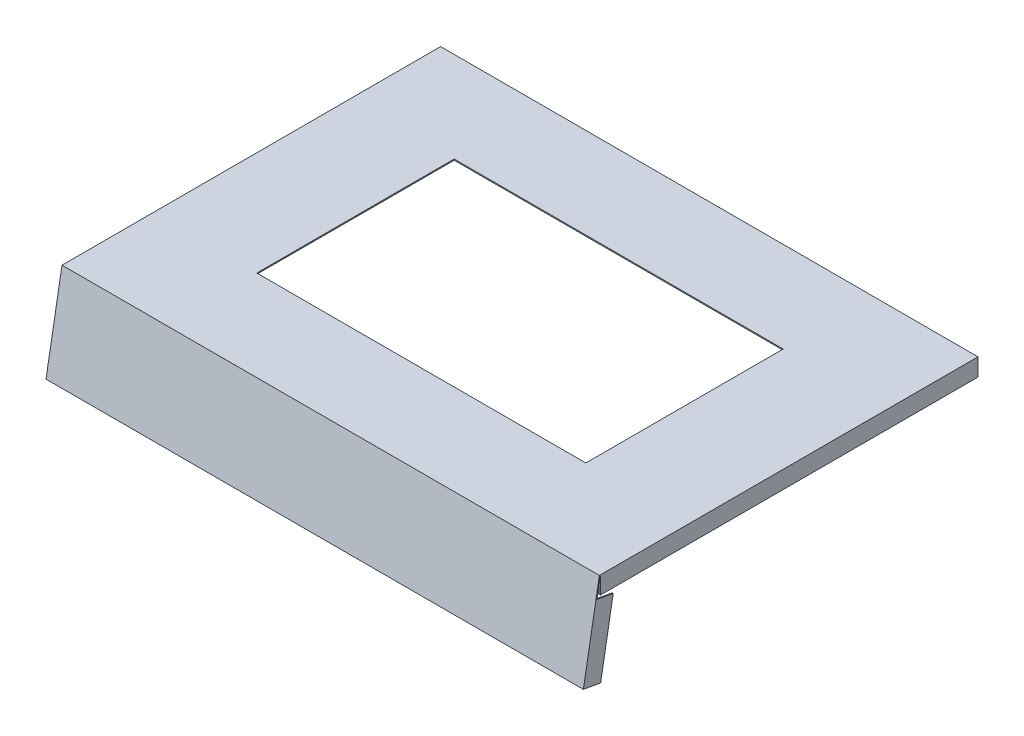
ISO-10303-21;
HEADER;
FILE_DESCRIPTION(('STEP AP214'),'2;1');
FILE_NAME('part.step','',(''),(''),'','','');
FILE_SCHEMA(('AUTOMOTIVE_DESIGN { 1 0 10303 214 1 1 1 1 }'));
ENDSEC;
DATA;
#1=APPLICATION_CONTEXT('core data for automotive mechanical design processes');
#2=APPLICATION_PROTOCOL_DEFINITION('international standard','automotive_design',2000,#1);
#3=PRODUCT_CONTEXT('',#1,'mechanical');
#4=PRODUCT('Part','Part','',(#3));
#5=PRODUCT_RELATED_PRODUCT_CATEGORY('part','',(#4));
#6=PRODUCT_DEFINITION_FORMATION('','',#4);
#7=PRODUCT_DEFINITION_CONTEXT('part definition',#1,'design');
#8=PRODUCT_DEFINITION('design','',#6,#7);
#9=PRODUCT_DEFINITION_SHAPE('','',#8);
#10=(LENGTH_UNIT() NAMED_UNIT(*) SI_UNIT(.MILLI.,.METRE.));
#11=(NAMED_UNIT(*) PLANE_ANGLE_UNIT() SI_UNIT($,.RADIAN.));
#12=(NAMED_UNIT(*) SI_UNIT($,.STERADIAN.) SOLID_ANGLE_UNIT());
#13=UNCERTAINTY_MEASURE_WITH_UNIT(LENGTH_MEASURE(1.E-05),#10,'distance_accuracy_value','');
#14=(GEOMETRIC_REPRESENTATION_CONTEXT(3) GLOBAL_UNCERTAINTY_ASSIGNED_CONTEXT((#13)) GLOBAL_UNIT_ASSIGNED_CONTEXT((#10,
#11,#12)) REPRESENTATION_CONTEXT('',''));
#15=CARTESIAN_POINT('',(0.,0.,0.));
#16=DIRECTION('',(0.,0.,1.));
#17=DIRECTION('',(1.,0.,0.));
#18=AXIS2_PLACEMENT_3D('',#15,#16,#17);
#19=CARTESIAN_POINT('',(-245.,-81.8974994306925,186.22663917101));
#20=DIRECTION('',(0.,-0.173648177666928,-0.984807753012209));
#21=DIRECTION('',(0.,0.984807753012209,-0.173648177666928));
#22=AXIS2_PLACEMENT_3D('',#19,#20,#21);
#23=PLANE('',#22);
#24=DIRECTION('',(0.,0.984807753012209,-0.173648177666928));
#25=VECTOR('',#24,1.);
#26=CARTESIAN_POINT('',(245.,-81.8974994306925,186.22663917101));
#27=LINE('',#26,#25);
#28=CARTESIAN_POINT('',(245.,-16.9001877318867,174.765859444992));
#29=VERTEX_POINT('',#28);
#30=CARTESIAN_POINT('',(245.,0.,171.785900368823));
#31=VERTEX_POINT('',#30);
#32=EDGE_CURVE('E258',#29,#31,#27,.T.);
#33=ORIENTED_EDGE('',*,*,#32,.F.);
#34=DIRECTION('',(1.,0.,0.));
#35=VECTOR('',#34,1.);
#36=CARTESIAN_POINT('',(244.,-16.9001877318867,174.765859444992));
#37=LINE('',#36,#35);
#38=CARTESIAN_POINT('',(244.,-16.9001877318867,174.765859444992));
#39=VERTEX_POINT('',#38);
#40=EDGE_CURVE('E203',#39,#29,#37,.T.);
#41=ORIENTED_EDGE('',*,*,#40,.F.);
#42=DIRECTION('',(0.,0.984807753012208,-0.173648177666927));
#43=VECTOR('',#42,1.);
#44=CARTESIAN_POINT('',(244.,-80.9126916776803,186.052990993343));
#45=LINE('',#44,#43);
#46=CARTESIAN_POINT('',(244.,-80.9126916776803,186.052990993343));
#47=VERTEX_POINT('',#46);
#48=EDGE_CURVE('E199',#47,#39,#45,.T.);
#49=ORIENTED_EDGE('',*,*,#48,.F.);
#50=DIRECTION('',(1.,0.,0.));
#51=VECTOR('',#50,1.);
#52=CARTESIAN_POINT('',(244.,-80.9126916776803,186.052990993343));
#53=LINE('',#52,#51);
#54=CARTESIAN_POINT('',(-244.,-80.9126916776803,186.052990993343));
#55=VERTEX_POINT('',#54);
#56=EDGE_CURVE('E350',#55,#47,#53,.T.);
#57=ORIENTED_EDGE('',*,*,#56,.F.);
#58=DIRECTION('',(0.,-0.984807753012209,0.173648177666927));
#59=VECTOR('',#58,1.);
#60=CARTESIAN_POINT('',(-244.,-80.9126916776803,186.052990993343));
#61=LINE('',#60,#59);
#62=CARTESIAN_POINT('',(-244.,-16.9001877318867,174.765859444992));
#63=VERTEX_POINT('',#62);
#64=EDGE_CURVE('E342',#63,#55,#61,.T.);
#65=ORIENTED_EDGE('',*,*,#64,.F.);
#66=DIRECTION('',(1.,0.,0.));
#67=VECTOR('',#66,1.);
#68=CARTESIAN_POINT('',(-244.,-16.9001877318867,174.765859444992));
#69=LINE('',#68,#67);
#70=CARTESIAN_POINT('',(-245.,-16.9001877318867,174.765859444992));
#71=VERTEX_POINT('',#70);
#72=EDGE_CURVE('E339',#71,#63,#69,.T.);
#73=ORIENTED_EDGE('',*,*,#72,.F.);
#74=DIRECTION('',(0.,0.984807753012209,-0.173648177666928));
#75=VECTOR('',#74,1.);
#76=CARTESIAN_POINT('',(-245.,-81.8974994306925,186.22663917101));
#77=LINE('',#76,#75);
#78=CARTESIAN_POINT('',(-245.,0.,171.785900368823));
#79=VERTEX_POINT('',#78);
#80=EDGE_CURVE('E260',#71,#79,#77,.T.);
#81=ORIENTED_EDGE('',*,*,#80,.T.);
#82=DIRECTION('',(1.,0.,0.));
#83=VECTOR('',#82,1.);
#84=CARTESIAN_POINT('',(0.,0.,171.785900368823));
#85=LINE('',#84,#83);
#86=CARTESIAN_POINT('',(-244.,0.,171.785900368823));
#87=VERTEX_POINT('',#86);
#88=EDGE_CURVE('E41',#79,#87,#85,.T.);
#89=ORIENTED_EDGE('',*,*,#88,.T.);
#90=CARTESIAN_POINT('',(244.,0.,171.785900368823));
#91=VERTEX_POINT('',#90);
#92=EDGE_CURVE('E309',#87,#91,#85,.T.);
#93=ORIENTED_EDGE('',*,*,#92,.T.);
#94=DIRECTION('',(-1.,0.,0.));
#95=VECTOR('',#94,1.);
#96=CARTESIAN_POINT('',(245.,0.,171.785900368823));
#97=LINE('',#96,#95);
#98=EDGE_CURVE('E205',#31,#91,#97,.T.);
#99=ORIENTED_EDGE('',*,*,#98,.F.);
#100=EDGE_LOOP('',(#33,#41,#49,#57,#65,#73,#81,#89,#93,#99));
#101=FACE_BOUND('',#100,.T.);
#102=ADVANCED_FACE('F33',(#101),#23,.T.);
#103=CARTESIAN_POINT('',(0.,0.,0.));
#104=DIRECTION('',(0.,-1.,0.));
#105=DIRECTION('',(0.,0.,-1.));
#106=AXIS2_PLACEMENT_3D('',#103,#104,#105);
#107=PLANE('',#106);
#108=DIRECTION('',(0.,0.,-1.));
#109=VECTOR('',#108,1.);
#110=CARTESIAN_POINT('',(150.,0.,90.));
#111=LINE('',#110,#109);
#112=CARTESIAN_POINT('',(150.,0.,90.));
#113=VERTEX_POINT('',#112);
#114=CARTESIAN_POINT('',(150.,0.,-90.));
#115=VERTEX_POINT('',#114);
#116=EDGE_CURVE('E267',#113,#115,#111,.T.);
#117=ORIENTED_EDGE('',*,*,#116,.T.);
#118=DIRECTION('',(-1.,0.,0.));
#119=VECTOR('',#118,1.);
#120=CARTESIAN_POINT('',(-150.,0.,-90.));
#121=LINE('',#120,#119);
#122=CARTESIAN_POINT('',(-150.,0.,-90.));
#123=VERTEX_POINT('',#122);
#124=EDGE_CURVE('E270',#115,#123,#121,.T.);
#125=ORIENTED_EDGE('',*,*,#124,.T.);
#126=DIRECTION('',(0.,0.,1.));
#127=VECTOR('',#126,1.);
#128=CARTESIAN_POINT('',(-150.,0.,90.));
#129=LINE('',#128,#127);
#130=CARTESIAN_POINT('',(-150.,0.,90.));
#131=VERTEX_POINT('',#130);
#132=EDGE_CURVE('E274',#123,#131,#129,.T.);
#133=ORIENTED_EDGE('',*,*,#132,.T.);
#134=DIRECTION('',(1.,0.,0.));
#135=VECTOR('',#134,1.);
#136=CARTESIAN_POINT('',(-150.,0.,90.));
#137=LINE('',#136,#135);
#138=EDGE_CURVE('E277',#131,#113,#137,.T.);
#139=ORIENTED_EDGE('',*,*,#138,.T.);
#140=EDGE_LOOP('',(#117,#125,#133,#139));
#141=FACE_BOUND('',#140,.T.);
#142=DIRECTION('',(-1.,0.,0.));
#143=VECTOR('',#142,1.);
#144=CARTESIAN_POINT('',(-244.,0.,-171.625));
#145=LINE('',#144,#143);
#146=CARTESIAN_POINT('',(244.,0.,-171.625));
#147=VERTEX_POINT('',#146);
#148=CARTESIAN_POINT('',(-244.,0.,-171.625));
#149=VERTEX_POINT('',#148);
#150=EDGE_CURVE('E235',#147,#149,#145,.T.);
#151=ORIENTED_EDGE('',*,*,#150,.F.);
#152=DIRECTION('',(0.,0.,-1.));
#153=VECTOR('',#152,1.);
#154=CARTESIAN_POINT('',(244.,0.,-171.625));
#155=LINE('',#154,#153);
#156=EDGE_CURVE('E208',#91,#147,#155,.T.);
#157=ORIENTED_EDGE('',*,*,#156,.F.);
#158=ORIENTED_EDGE('',*,*,#92,.F.);
#159=DIRECTION('',(0.,0.,1.));
#160=VECTOR('',#159,1.);
#161=CARTESIAN_POINT('',(-244.,0.,-171.625));
#162=LINE('',#161,#160);
#163=EDGE_CURVE('E218',#149,#87,#162,.T.);
#164=ORIENTED_EDGE('',*,*,#163,.F.);
#165=EDGE_LOOP('',(#151,#157,#158,#164));
#166=FACE_BOUND('',#165,.T.);
#167=ADVANCED_FACE('F319',(#141,#166),#107,.T.);
#168=CARTESIAN_POINT('',(245.,1.,172.625));
#169=DIRECTION('',(-1.,0.,0.));
#170=DIRECTION('',(0.,0.,1.));
#171=AXIS2_PLACEMENT_3D('',#168,#169,#170);
#172=PLANE('',#171);
#173=DIRECTION('',(0.,-1.,0.));
#174=VECTOR('',#173,1.);
#175=CARTESIAN_POINT('',(245.,1.,-172.625));
#176=LINE('',#175,#174);
#177=CARTESIAN_POINT('',(245.,1.,-172.625));
#178=VERTEX_POINT('',#177);
#179=CARTESIAN_POINT('',(245.,-15.,-172.625));
#180=VERTEX_POINT('',#179);
#181=EDGE_CURVE('E308',#178,#180,#176,.T.);
#182=ORIENTED_EDGE('',*,*,#181,.F.);
#183=DIRECTION('',(0.,0.,-1.));
#184=VECTOR('',#183,1.);
#185=CARTESIAN_POINT('',(245.,1.,172.625));
#186=LINE('',#185,#184);
#187=CARTESIAN_POINT('',(245.,1.,172.625));
#188=VERTEX_POINT('',#187);
#189=EDGE_CURVE('E292',#188,#178,#186,.T.);
#190=ORIENTED_EDGE('',*,*,#189,.F.);
#191=DIRECTION('',(0.,-0.984807753012209,0.173648177666927));
#192=VECTOR('',#191,1.);
#193=CARTESIAN_POINT('',(245.,1.,172.625));
#194=LINE('',#193,#192);
#195=CARTESIAN_POINT('',(245.,-81.7238512530255,187.211446924022));
#196=VERTEX_POINT('',#195);
#197=EDGE_CURVE('E253',#188,#196,#194,.T.);
#198=ORIENTED_EDGE('',*,*,#197,.T.);
#199=DIRECTION('',(0.,-0.173648177666948,-0.984807753012205));
#200=VECTOR('',#199,1.);
#201=CARTESIAN_POINT('',(245.,-81.7238512530255,187.211446924022));
#202=LINE('',#201,#200);
#203=CARTESIAN_POINT('',(245.,-84.5022220956964,171.454522875826));
#204=VERTEX_POINT('',#203);
#205=EDGE_CURVE('E185',#196,#204,#202,.T.);
#206=ORIENTED_EDGE('',*,*,#205,.T.);
#207=DIRECTION('',(0.,-0.984807753012208,0.173648177666927));
#208=VECTOR('',#207,1.);
#209=CARTESIAN_POINT('',(245.,-19.5049103968907,159.993743149809));
#210=LINE('',#209,#208);
#211=CARTESIAN_POINT('',(245.,-19.5049103968907,159.993743149809));
#212=VERTEX_POINT('',#211);
#213=EDGE_CURVE('E177',#212,#204,#210,.T.);
#214=ORIENTED_EDGE('',*,*,#213,.F.);
#215=DIRECTION('',(0.,0.173648177666927,0.984807753012209));
#216=VECTOR('',#215,1.);
#217=CARTESIAN_POINT('',(245.,-19.5049103968907,159.993743149809));
#218=LINE('',#217,#216);
#219=EDGE_CURVE('E181',#212,#29,#218,.T.);
#220=ORIENTED_EDGE('',*,*,#219,.T.);
#221=ORIENTED_EDGE('',*,*,#32,.T.);
#222=DIRECTION('',(0.,1.,0.));
#223=VECTOR('',#222,1.);
#224=CARTESIAN_POINT('',(245.,-15.,171.785900368823));
#225=LINE('',#224,#223);
#226=CARTESIAN_POINT('',(245.,-15.,171.785900368823));
#227=VERTEX_POINT('',#226);
#228=EDGE_CURVE('E250',#227,#31,#225,.T.);
#229=ORIENTED_EDGE('',*,*,#228,.F.);
#230=DIRECTION('',(0.,0.,1.));
#231=VECTOR('',#230,1.);
#232=CARTESIAN_POINT('',(245.,-15.,-172.625));
#233=LINE('',#232,#231);
#234=EDGE_CURVE('E217',#180,#227,#233,.T.);
#235=ORIENTED_EDGE('',*,*,#234,.F.);
#236=EDGE_LOOP('',(#182,#190,#198,#206,#214,#220,#221,#229,#235));
#237=FACE_BOUND('',#236,.T.);
#238=ADVANCED_FACE('F35',(#237),#172,.F.);
#239=CARTESIAN_POINT('',(-245.,1.,-172.625));
#240=DIRECTION('',(0.,0.,1.));
#241=DIRECTION('',(1.,0.,0.));
#242=AXIS2_PLACEMENT_3D('',#239,#240,#241);
#243=PLANE('',#242);
#244=ORIENTED_EDGE('',*,*,#181,.T.);
#245=DIRECTION('',(1.,0.,0.));
#246=VECTOR('',#245,1.);
#247=CARTESIAN_POINT('',(-245.,-15.,-172.625));
#248=LINE('',#247,#246);
#249=CARTESIAN_POINT('',(-245.,-15.,-172.625));
#250=VERTEX_POINT('',#249);
#251=EDGE_CURVE('E214',#250,#180,#248,.T.);
#252=ORIENTED_EDGE('',*,*,#251,.F.);
#253=DIRECTION('',(0.,-1.,0.));
#254=VECTOR('',#253,1.);
#255=CARTESIAN_POINT('',(-245.,1.,-172.625));
#256=LINE('',#255,#254);
#257=CARTESIAN_POINT('',(-245.,1.,-172.625));
#258=VERTEX_POINT('',#257);
#259=EDGE_CURVE('E306',#258,#250,#256,.T.);
#260=ORIENTED_EDGE('',*,*,#259,.F.);
#261=DIRECTION('',(-1.,0.,0.));
#262=VECTOR('',#261,1.);
#263=CARTESIAN_POINT('',(-245.,1.,-172.625));
#264=LINE('',#263,#262);
#265=EDGE_CURVE('E299',#178,#258,#264,.T.);
#266=ORIENTED_EDGE('',*,*,#265,.F.);
#267=EDGE_LOOP('',(#244,#252,#260,#266));
#268=FACE_BOUND('',#267,.T.);
#269=ADVANCED_FACE('F438',(#268),#243,.F.);
#270=CARTESIAN_POINT('',(-245.,1.,172.625));
#271=DIRECTION('',(1.,0.,0.));
#272=DIRECTION('',(0.,0.,-1.));
#273=AXIS2_PLACEMENT_3D('',#270,#271,#272);
#274=PLANE('',#273);
#275=CARTESIAN_POINT('',(-245.,-7.,-166.625));
#276=DIRECTION('',(1.,0.,0.));
#277=DIRECTION('',(0.,0.,-1.));
#278=AXIS2_PLACEMENT_3D('',#275,#276,#277);
#279=CIRCLE('',#278,1.5);
#280=CARTESIAN_POINT('',(-245.,-7.,-168.125));
#281=VERTEX_POINT('',#280);
#282=EDGE_CURVE('E11',#281,#281,#279,.F.);
#283=ORIENTED_EDGE('',*,*,#282,.F.);
#284=EDGE_LOOP('',(#283));
#285=FACE_BOUND('',#284,.T.);
#286=ORIENTED_EDGE('',*,*,#259,.T.);
#287=DIRECTION('',(0.,0.,-1.));
#288=VECTOR('',#287,1.);
#289=CARTESIAN_POINT('',(-245.,-15.,-172.625));
#290=LINE('',#289,#288);
#291=CARTESIAN_POINT('',(-245.,-15.,171.785900368823));
#292=VERTEX_POINT('',#291);
#293=EDGE_CURVE('E230',#292,#250,#290,.T.);
#294=ORIENTED_EDGE('',*,*,#293,.F.);
#295=DIRECTION('',(0.,1.,0.));
#296=VECTOR('',#295,1.);
#297=CARTESIAN_POINT('',(-245.,-15.,171.785900368823));
#298=LINE('',#297,#296);
#299=EDGE_CURVE('E232',#292,#79,#298,.T.);
#300=ORIENTED_EDGE('',*,*,#299,.T.);
#301=ORIENTED_EDGE('',*,*,#80,.F.);
#302=DIRECTION('',(0.,0.173648177666927,0.984807753012209));
#303=VECTOR('',#302,1.);
#304=CARTESIAN_POINT('',(-245.,-19.5049103968906,159.993743149809));
#305=LINE('',#304,#303);
#306=CARTESIAN_POINT('',(-245.,-19.5049103968906,159.993743149809));
#307=VERTEX_POINT('',#306);
#308=EDGE_CURVE('E206',#307,#71,#305,.T.);
#309=ORIENTED_EDGE('',*,*,#308,.F.);
#310=DIRECTION('',(0.,0.984807753012209,-0.173648177666927));
#311=VECTOR('',#310,1.);
#312=CARTESIAN_POINT('',(-245.,-19.5049103968906,159.993743149809));
#313=LINE('',#312,#311);
#314=CARTESIAN_POINT('',(-245.,-84.5022220956964,171.454522875826));
#315=VERTEX_POINT('',#314);
#316=EDGE_CURVE('E383',#315,#307,#313,.T.);
#317=ORIENTED_EDGE('',*,*,#316,.F.);
#318=DIRECTION('',(0.,-0.173648177666948,-0.984807753012205));
#319=VECTOR('',#318,1.);
#320=CARTESIAN_POINT('',(-245.,-81.7238512530255,187.211446924022));
#321=LINE('',#320,#319);
#322=CARTESIAN_POINT('',(-245.,-81.7238512530255,187.211446924022));
#323=VERTEX_POINT('',#322);
#324=EDGE_CURVE('E257',#323,#315,#321,.T.);
#325=ORIENTED_EDGE('',*,*,#324,.F.);
#326=DIRECTION('',(0.,-0.984807753012209,0.173648177666927));
#327=VECTOR('',#326,1.);
#328=CARTESIAN_POINT('',(-245.,1.,172.625));
#329=LINE('',#328,#327);
#330=CARTESIAN_POINT('',(-245.,1.,172.625));
#331=VERTEX_POINT('',#330);
#332=EDGE_CURVE('E254',#331,#323,#329,.T.);
#333=ORIENTED_EDGE('',*,*,#332,.F.);
#334=DIRECTION('',(0.,0.,1.));
#335=VECTOR('',#334,1.);
#336=CARTESIAN_POINT('',(-245.,1.,172.625));
#337=LINE('',#336,#335);
#338=EDGE_CURVE('E301',#258,#331,#337,.T.);
#339=ORIENTED_EDGE('',*,*,#338,.F.);
#340=EDGE_LOOP('',(#286,#294,#300,#301,#309,#317,#325,#333,#339));
#341=FACE_BOUND('',#340,.T.);
#342=ADVANCED_FACE('F390',(#285,#341),#274,.F.);
#343=CARTESIAN_POINT('',(0.,1.,0.));
#344=DIRECTION('',(0.,-1.,0.));
#345=DIRECTION('',(0.,0.,-1.));
#346=AXIS2_PLACEMENT_3D('',#343,#344,#345);
#347=PLANE('',#346);
#348=DIRECTION('',(-1.,0.,0.));
#349=VECTOR('',#348,1.);
#350=CARTESIAN_POINT('',(-150.,1.,-90.));
#351=LINE('',#350,#349);
#352=CARTESIAN_POINT('',(150.,1.,-90.));
#353=VERTEX_POINT('',#352);
#354=CARTESIAN_POINT('',(-150.,1.,-90.));
#355=VERTEX_POINT('',#354);
#356=EDGE_CURVE('E282',#353,#355,#351,.T.);
#357=ORIENTED_EDGE('',*,*,#356,.F.);
#358=DIRECTION('',(0.,0.,-1.));
#359=VECTOR('',#358,1.);
#360=CARTESIAN_POINT('',(150.,1.,90.));
#361=LINE('',#360,#359);
#362=CARTESIAN_POINT('',(150.,1.,90.));
#363=VERTEX_POINT('',#362);
#364=EDGE_CURVE('E56',#363,#353,#361,.T.);
#365=ORIENTED_EDGE('',*,*,#364,.F.);
#366=DIRECTION('',(1.,0.,0.));
#367=VECTOR('',#366,1.);
#368=CARTESIAN_POINT('',(-150.,1.,90.));
#369=LINE('',#368,#367);
#370=CARTESIAN_POINT('',(-150.,1.,90.));
#371=VERTEX_POINT('',#370);
#372=EDGE_CURVE('E271',#371,#363,#369,.T.);
#373=ORIENTED_EDGE('',*,*,#372,.F.);
#374=DIRECTION('',(0.,0.,1.));
#375=VECTOR('',#374,1.);
#376=CARTESIAN_POINT('',(-150.,1.,90.));
#377=LINE('',#376,#375);
#378=EDGE_CURVE('E285',#355,#371,#377,.T.);
#379=ORIENTED_EDGE('',*,*,#378,.F.);
#380=EDGE_LOOP('',(#357,#365,#373,#379));
#381=FACE_BOUND('',#380,.T.);
#382=ORIENTED_EDGE('',*,*,#338,.T.);
#383=DIRECTION('',(1.,0.,0.));
#384=VECTOR('',#383,1.);
#385=CARTESIAN_POINT('',(-245.,1.,172.625));
#386=LINE('',#385,#384);
#387=EDGE_CURVE('E303',#331,#188,#386,.T.);
#388=ORIENTED_EDGE('',*,*,#387,.T.);
#389=ORIENTED_EDGE('',*,*,#189,.T.);
#390=ORIENTED_EDGE('',*,*,#265,.T.);
#391=EDGE_LOOP('',(#382,#388,#389,#390));
#392=FACE_BOUND('',#391,.T.);
#393=ADVANCED_FACE('F433',(#381,#392),#347,.F.);
#394=CARTESIAN_POINT('',(150.,0.,90.));
#395=DIRECTION('',(1.,0.,0.));
#396=DIRECTION('',(0.,0.,-1.));
#397=AXIS2_PLACEMENT_3D('',#394,#395,#396);
#398=PLANE('',#397);
#399=ORIENTED_EDGE('',*,*,#364,.T.);
#400=DIRECTION('',(0.,1.,0.));
#401=VECTOR('',#400,1.);
#402=CARTESIAN_POINT('',(150.,0.,-90.));
#403=LINE('',#402,#401);
#404=EDGE_CURVE('E280',#115,#353,#403,.T.);
#405=ORIENTED_EDGE('',*,*,#404,.F.);
#406=ORIENTED_EDGE('',*,*,#116,.F.);
#407=DIRECTION('',(0.,1.,0.));
#408=VECTOR('',#407,1.);
#409=CARTESIAN_POINT('',(150.,0.,90.));
#410=LINE('',#409,#408);
#411=EDGE_CURVE('E290',#113,#363,#410,.T.);
#412=ORIENTED_EDGE('',*,*,#411,.T.);
#413=EDGE_LOOP('',(#399,#405,#406,#412));
#414=FACE_BOUND('',#413,.T.);
#415=ADVANCED_FACE('F423',(#414),#398,.F.);
#416=CARTESIAN_POINT('',(-150.,0.,90.));
#417=DIRECTION('',(0.,0.,1.));
#418=DIRECTION('',(1.,0.,0.));
#419=AXIS2_PLACEMENT_3D('',#416,#417,#418);
#420=PLANE('',#419);
#421=ORIENTED_EDGE('',*,*,#372,.T.);
#422=ORIENTED_EDGE('',*,*,#411,.F.);
#423=ORIENTED_EDGE('',*,*,#138,.F.);
#424=DIRECTION('',(0.,1.,0.));
#425=VECTOR('',#424,1.);
#426=CARTESIAN_POINT('',(-150.,0.,90.));
#427=LINE('',#426,#425);
#428=EDGE_CURVE('E293',#131,#371,#427,.T.);
#429=ORIENTED_EDGE('',*,*,#428,.T.);
#430=EDGE_LOOP('',(#421,#422,#423,#429));
#431=FACE_BOUND('',#430,.T.);
#432=ADVANCED_FACE('F419',(#431),#420,.F.);
#433=CARTESIAN_POINT('',(-150.,0.,90.));
#434=DIRECTION('',(-1.,0.,0.));
#435=DIRECTION('',(0.,0.,1.));
#436=AXIS2_PLACEMENT_3D('',#433,#434,#435);
#437=PLANE('',#436);
#438=ORIENTED_EDGE('',*,*,#378,.T.);
#439=ORIENTED_EDGE('',*,*,#428,.F.);
#440=ORIENTED_EDGE('',*,*,#132,.F.);
#441=DIRECTION('',(0.,1.,0.));
#442=VECTOR('',#441,1.);
#443=CARTESIAN_POINT('',(-150.,0.,-90.));
#444=LINE('',#443,#442);
#445=EDGE_CURVE('E295',#123,#355,#444,.T.);
#446=ORIENTED_EDGE('',*,*,#445,.T.);
#447=EDGE_LOOP('',(#438,#439,#440,#446));
#448=FACE_BOUND('',#447,.T.);
#449=ADVANCED_FACE('F422',(#448),#437,.F.);
#450=CARTESIAN_POINT('',(-150.,0.,-90.));
#451=DIRECTION('',(0.,0.,-1.));
#452=DIRECTION('',(-1.,0.,0.));
#453=AXIS2_PLACEMENT_3D('',#450,#451,#452);
#454=PLANE('',#453);
#455=ORIENTED_EDGE('',*,*,#356,.T.);
#456=ORIENTED_EDGE('',*,*,#445,.F.);
#457=ORIENTED_EDGE('',*,*,#124,.F.);
#458=ORIENTED_EDGE('',*,*,#404,.T.);
#459=EDGE_LOOP('',(#455,#456,#457,#458));
#460=FACE_BOUND('',#459,.T.);
#461=ADVANCED_FACE('F415',(#460),#454,.F.);
#462=CARTESIAN_POINT('',(-245.,-81.7238512530255,187.211446924022));
#463=DIRECTION('',(0.,-0.984807753012205,0.173648177666948));
#464=DIRECTION('',(0.,-0.173648177666948,-0.984807753012205));
#465=AXIS2_PLACEMENT_3D('',#462,#463,#464);
#466=PLANE('',#465);
#467=ORIENTED_EDGE('',*,*,#205,.F.);
#468=DIRECTION('',(1.,0.,0.));
#469=VECTOR('',#468,1.);
#470=CARTESIAN_POINT('',(-245.,-81.7238512530255,187.211446924022));
#471=LINE('',#470,#469);
#472=EDGE_CURVE('E262',#323,#196,#471,.T.);
#473=ORIENTED_EDGE('',*,*,#472,.F.);
#474=ORIENTED_EDGE('',*,*,#324,.T.);
#475=DIRECTION('',(-1.,0.,0.));
#476=VECTOR('',#475,1.);
#477=CARTESIAN_POINT('',(245.,-84.5022220956964,171.454522875826));
#478=LINE('',#477,#476);
#479=EDGE_CURVE('E189',#204,#315,#478,.T.);
#480=ORIENTED_EDGE('',*,*,#479,.F.);
#481=EDGE_LOOP('',(#467,#473,#474,#480));
#482=FACE_BOUND('',#481,.T.);
#483=ADVANCED_FACE('F411',(#482),#466,.T.);
#484=CARTESIAN_POINT('',(-245.,1.,172.625));
#485=DIRECTION('',(0.,0.173648177666927,0.984807753012209));
#486=DIRECTION('',(0.,-0.984807753012209,0.173648177666927));
#487=AXIS2_PLACEMENT_3D('',#484,#485,#486);
#488=PLANE('',#487);
#489=ORIENTED_EDGE('',*,*,#197,.F.);
#490=ORIENTED_EDGE('',*,*,#387,.F.);
#491=ORIENTED_EDGE('',*,*,#332,.T.);
#492=ORIENTED_EDGE('',*,*,#472,.T.);
#493=EDGE_LOOP('',(#489,#490,#491,#492));
#494=FACE_BOUND('',#493,.T.);
#495=ADVANCED_FACE('F414',(#494),#488,.T.);
#496=CARTESIAN_POINT('',(245.,-15.,171.785900368823));
#497=DIRECTION('',(0.,0.,-1.));
#498=DIRECTION('',(-1.,0.,0.));
#499=AXIS2_PLACEMENT_3D('',#496,#497,#498);
#500=PLANE('',#499);
#501=ORIENTED_EDGE('',*,*,#98,.T.);
#502=DIRECTION('',(0.,1.,0.));
#503=VECTOR('',#502,1.);
#504=CARTESIAN_POINT('',(244.,-15.,171.785900368823));
#505=LINE('',#504,#503);
#506=CARTESIAN_POINT('',(244.,-15.,171.785900368823));
#507=VERTEX_POINT('',#506);
#508=EDGE_CURVE('E247',#507,#91,#505,.T.);
#509=ORIENTED_EDGE('',*,*,#508,.F.);
#510=DIRECTION('',(-1.,0.,0.));
#511=VECTOR('',#510,1.);
#512=CARTESIAN_POINT('',(245.,-15.,171.785900368823));
#513=LINE('',#512,#511);
#514=EDGE_CURVE('E220',#227,#507,#513,.T.);
#515=ORIENTED_EDGE('',*,*,#514,.F.);
#516=ORIENTED_EDGE('',*,*,#228,.T.);
#517=EDGE_LOOP('',(#501,#509,#515,#516));
#518=FACE_BOUND('',#517,.T.);
#519=ADVANCED_FACE('F336',(#518),#500,.F.);
#520=CARTESIAN_POINT('',(244.,-15.,-171.625));
#521=DIRECTION('',(1.,0.,0.));
#522=DIRECTION('',(0.,0.,-1.));
#523=AXIS2_PLACEMENT_3D('',#520,#521,#522);
#524=PLANE('',#523);
#525=ORIENTED_EDGE('',*,*,#156,.T.);
#526=DIRECTION('',(0.,1.,0.));
#527=VECTOR('',#526,1.);
#528=CARTESIAN_POINT('',(244.,-15.,-171.625));
#529=LINE('',#528,#527);
#530=CARTESIAN_POINT('',(244.,-15.,-171.625));
#531=VERTEX_POINT('',#530);
#532=EDGE_CURVE('E244',#531,#147,#529,.T.);
#533=ORIENTED_EDGE('',*,*,#532,.F.);
#534=DIRECTION('',(0.,0.,-1.));
#535=VECTOR('',#534,1.);
#536=CARTESIAN_POINT('',(244.,-15.,-171.625));
#537=LINE('',#536,#535);
#538=EDGE_CURVE('E222',#507,#531,#537,.T.);
#539=ORIENTED_EDGE('',*,*,#538,.F.);
#540=ORIENTED_EDGE('',*,*,#508,.T.);
#541=EDGE_LOOP('',(#525,#533,#539,#540));
#542=FACE_BOUND('',#541,.T.);
#543=ADVANCED_FACE('F322',(#542),#524,.F.);
#544=CARTESIAN_POINT('',(-244.,-15.,-171.625));
#545=DIRECTION('',(0.,0.,-1.));
#546=DIRECTION('',(-1.,0.,0.));
#547=AXIS2_PLACEMENT_3D('',#544,#545,#546);
#548=PLANE('',#547);
#549=ORIENTED_EDGE('',*,*,#150,.T.);
#550=DIRECTION('',(0.,1.,0.));
#551=VECTOR('',#550,1.);
#552=CARTESIAN_POINT('',(-244.,-15.,-171.625));
#553=LINE('',#552,#551);
#554=CARTESIAN_POINT('',(-244.,-15.,-171.625));
#555=VERTEX_POINT('',#554);
#556=EDGE_CURVE('E241',#555,#149,#553,.T.);
#557=ORIENTED_EDGE('',*,*,#556,.F.);
#558=DIRECTION('',(-1.,0.,0.));
#559=VECTOR('',#558,1.);
#560=CARTESIAN_POINT('',(-244.,-15.,-171.625));
#561=LINE('',#560,#559);
#562=EDGE_CURVE('E224',#531,#555,#561,.T.);
#563=ORIENTED_EDGE('',*,*,#562,.F.);
#564=ORIENTED_EDGE('',*,*,#532,.T.);
#565=EDGE_LOOP('',(#549,#557,#563,#564));
#566=FACE_BOUND('',#565,.T.);
#567=ADVANCED_FACE('F327',(#566),#548,.F.);
#568=CARTESIAN_POINT('',(-244.,-15.,-171.625));
#569=DIRECTION('',(-1.,0.,0.));
#570=DIRECTION('',(0.,0.,1.));
#571=AXIS2_PLACEMENT_3D('',#568,#569,#570);
#572=PLANE('',#571);
#573=ORIENTED_EDGE('',*,*,#163,.T.);
#574=DIRECTION('',(0.,1.,0.));
#575=VECTOR('',#574,1.);
#576=CARTESIAN_POINT('',(-244.,-15.,171.785900368823));
#577=LINE('',#576,#575);
#578=CARTESIAN_POINT('',(-244.,-15.,171.785900368823));
#579=VERTEX_POINT('',#578);
#580=EDGE_CURVE('E48',#579,#87,#577,.T.);
#581=ORIENTED_EDGE('',*,*,#580,.F.);
#582=DIRECTION('',(0.,0.,1.));
#583=VECTOR('',#582,1.);
#584=CARTESIAN_POINT('',(-244.,-15.,-171.625));
#585=LINE('',#584,#583);
#586=EDGE_CURVE('E226',#555,#579,#585,.T.);
#587=ORIENTED_EDGE('',*,*,#586,.F.);
#588=ORIENTED_EDGE('',*,*,#556,.T.);
#589=EDGE_LOOP('',(#573,#581,#587,#588));
#590=FACE_BOUND('',#589,.T.);
#591=ADVANCED_FACE('F456',(#590),#572,.F.);
#592=CARTESIAN_POINT('',(-245.,-15.,171.785900368823));
#593=DIRECTION('',(0.,0.,-1.));
#594=DIRECTION('',(-1.,0.,0.));
#595=AXIS2_PLACEMENT_3D('',#592,#593,#594);
#596=PLANE('',#595);
#597=ORIENTED_EDGE('',*,*,#88,.F.);
#598=ORIENTED_EDGE('',*,*,#299,.F.);
#599=DIRECTION('',(-1.,0.,0.));
#600=VECTOR('',#599,1.);
#601=CARTESIAN_POINT('',(-245.,-15.,171.785900368823));
#602=LINE('',#601,#600);
#603=EDGE_CURVE('E228',#579,#292,#602,.T.);
#604=ORIENTED_EDGE('',*,*,#603,.F.);
#605=ORIENTED_EDGE('',*,*,#580,.T.);
#606=EDGE_LOOP('',(#597,#598,#604,#605));
#607=FACE_BOUND('',#606,.T.);
#608=ADVANCED_FACE('F454',(#607),#596,.F.);
#609=CARTESIAN_POINT('',(0.,-15.,0.));
#610=DIRECTION('',(0.,-1.,0.));
#611=DIRECTION('',(0.,0.,-1.));
#612=AXIS2_PLACEMENT_3D('',#609,#610,#611);
#613=PLANE('',#612);
#614=ORIENTED_EDGE('',*,*,#251,.T.);
#615=ORIENTED_EDGE('',*,*,#234,.T.);
#616=ORIENTED_EDGE('',*,*,#514,.T.);
#617=ORIENTED_EDGE('',*,*,#538,.T.);
#618=ORIENTED_EDGE('',*,*,#562,.T.);
#619=ORIENTED_EDGE('',*,*,#586,.T.);
#620=ORIENTED_EDGE('',*,*,#603,.T.);
#621=ORIENTED_EDGE('',*,*,#293,.T.);
#622=EDGE_LOOP('',(#614,#615,#616,#617,#618,#619,#620,#621));
#623=FACE_BOUND('',#622,.T.);
#624=ADVANCED_FACE('F331',(#623),#613,.T.);
#625=CARTESIAN_POINT('',(244.,-19.5049103968907,159.993743149809));
#626=DIRECTION('',(0.,-0.984807753012209,0.173648177666927));
#627=DIRECTION('',(0.,-0.173648177666927,-0.984807753012209));
#628=AXIS2_PLACEMENT_3D('',#625,#626,#627);
#629=PLANE('',#628);
#630=ORIENTED_EDGE('',*,*,#40,.T.);
#631=ORIENTED_EDGE('',*,*,#219,.F.);
#632=DIRECTION('',(1.,0.,0.));
#633=VECTOR('',#632,1.);
#634=CARTESIAN_POINT('',(244.,-19.5049103968907,159.993743149809));
#635=LINE('',#634,#633);
#636=CARTESIAN_POINT('',(244.,-19.5049103968907,159.993743149809));
#637=VERTEX_POINT('',#636);
#638=EDGE_CURVE('E190',#637,#212,#635,.T.);
#639=ORIENTED_EDGE('',*,*,#638,.F.);
#640=DIRECTION('',(0.,0.173648177666927,0.984807753012209));
#641=VECTOR('',#640,1.);
#642=CARTESIAN_POINT('',(244.,-19.5049103968907,159.993743149809));
#643=LINE('',#642,#641);
#644=EDGE_CURVE('E353',#637,#39,#643,.T.);
#645=ORIENTED_EDGE('',*,*,#644,.T.);
#646=EDGE_LOOP('',(#630,#631,#639,#645));
#647=FACE_BOUND('',#646,.T.);
#648=ADVANCED_FACE('F201',(#647),#629,.F.);
#649=CARTESIAN_POINT('',(-244.,-19.5049103968906,159.993743149809));
#650=DIRECTION('',(0.,-0.984807753012209,0.173648177666927));
#651=DIRECTION('',(0.,-0.173648177666927,-0.984807753012209));
#652=AXIS2_PLACEMENT_3D('',#649,#650,#651);
#653=PLANE('',#652);
#654=ORIENTED_EDGE('',*,*,#72,.T.);
#655=DIRECTION('',(0.,0.173648177666927,0.984807753012209));
#656=VECTOR('',#655,1.);
#657=CARTESIAN_POINT('',(-244.,-19.5049103968906,159.993743149809));
#658=LINE('',#657,#656);
#659=CARTESIAN_POINT('',(-244.,-19.5049103968906,159.993743149809));
#660=VERTEX_POINT('',#659);
#661=EDGE_CURVE('E210',#660,#63,#658,.T.);
#662=ORIENTED_EDGE('',*,*,#661,.F.);
#663=DIRECTION('',(1.,0.,0.));
#664=VECTOR('',#663,1.);
#665=CARTESIAN_POINT('',(-244.,-19.5049103968906,159.993743149809));
#666=LINE('',#665,#664);
#667=EDGE_CURVE('E379',#307,#660,#666,.T.);
#668=ORIENTED_EDGE('',*,*,#667,.F.);
#669=ORIENTED_EDGE('',*,*,#308,.T.);
#670=EDGE_LOOP('',(#654,#662,#668,#669));
#671=FACE_BOUND('',#670,.T.);
#672=ADVANCED_FACE('F392',(#671),#653,.F.);
#673=CARTESIAN_POINT('',(-244.,-83.5174143426842,171.28087469816));
#674=DIRECTION('',(-1.,0.,0.));
#675=DIRECTION('',(0.,-1.,0.));
#676=AXIS2_PLACEMENT_3D('',#673,#674,#675);
#677=PLANE('',#676);
#678=ORIENTED_EDGE('',*,*,#64,.T.);
#679=DIRECTION('',(0.,0.173648177666927,0.984807753012209));
#680=VECTOR('',#679,1.);
#681=CARTESIAN_POINT('',(-244.,-83.5174143426842,171.28087469816));
#682=LINE('',#681,#680);
#683=CARTESIAN_POINT('',(-244.,-83.5174143426842,171.28087469816));
#684=VERTEX_POINT('',#683);
#685=EDGE_CURVE('E358',#684,#55,#682,.T.);
#686=ORIENTED_EDGE('',*,*,#685,.F.);
#687=DIRECTION('',(0.,-0.984807753012209,0.173648177666927));
#688=VECTOR('',#687,1.);
#689=CARTESIAN_POINT('',(-244.,-83.5174143426842,171.28087469816));
#690=LINE('',#689,#688);
#691=EDGE_CURVE('E367',#660,#684,#690,.T.);
#692=ORIENTED_EDGE('',*,*,#691,.F.);
#693=ORIENTED_EDGE('',*,*,#661,.T.);
#694=EDGE_LOOP('',(#678,#686,#692,#693));
#695=FACE_BOUND('',#694,.T.);
#696=ADVANCED_FACE('F365',(#695),#677,.F.);
#697=CARTESIAN_POINT('',(244.,-83.5174143426842,171.28087469816));
#698=DIRECTION('',(0.,-0.984807753012208,0.173648177666927));
#699=DIRECTION('',(0.,-0.173648177666927,-0.984807753012209));
#700=AXIS2_PLACEMENT_3D('',#697,#698,#699);
#701=PLANE('',#700);
#702=ORIENTED_EDGE('',*,*,#56,.T.);
#703=DIRECTION('',(0.,0.173648177666927,0.984807753012209));
#704=VECTOR('',#703,1.);
#705=CARTESIAN_POINT('',(244.,-83.5174143426842,171.28087469816));
#706=LINE('',#705,#704);
#707=CARTESIAN_POINT('',(244.,-83.5174143426842,171.28087469816));
#708=VERTEX_POINT('',#707);
#709=EDGE_CURVE('E355',#708,#47,#706,.T.);
#710=ORIENTED_EDGE('',*,*,#709,.F.);
#711=DIRECTION('',(1.,0.,0.));
#712=VECTOR('',#711,1.);
#713=CARTESIAN_POINT('',(244.,-83.5174143426842,171.28087469816));
#714=LINE('',#713,#712);
#715=EDGE_CURVE('E378',#684,#708,#714,.T.);
#716=ORIENTED_EDGE('',*,*,#715,.F.);
#717=ORIENTED_EDGE('',*,*,#685,.T.);
#718=EDGE_LOOP('',(#702,#710,#716,#717));
#719=FACE_BOUND('',#718,.T.);
#720=ADVANCED_FACE('F374',(#719),#701,.F.);
#721=CARTESIAN_POINT('',(244.,-83.5174143426842,171.28087469816));
#722=DIRECTION('',(1.,0.,0.));
#723=DIRECTION('',(0.,0.,-1.));
#724=AXIS2_PLACEMENT_3D('',#721,#722,#723);
#725=PLANE('',#724);
#726=ORIENTED_EDGE('',*,*,#48,.T.);
#727=ORIENTED_EDGE('',*,*,#644,.F.);
#728=DIRECTION('',(0.,0.984807753012208,-0.173648177666927));
#729=VECTOR('',#728,1.);
#730=CARTESIAN_POINT('',(244.,-83.5174143426842,171.28087469816));
#731=LINE('',#730,#729);
#732=EDGE_CURVE('E195',#708,#637,#731,.T.);
#733=ORIENTED_EDGE('',*,*,#732,.F.);
#734=ORIENTED_EDGE('',*,*,#709,.T.);
#735=EDGE_LOOP('',(#726,#727,#733,#734));
#736=FACE_BOUND('',#735,.T.);
#737=ADVANCED_FACE('F377',(#736),#725,.F.);
#738=CARTESIAN_POINT('',(0.,26.7723964677325,151.833805355051));
#739=DIRECTION('',(0.,-0.173648177666927,-0.984807753012209));
#740=DIRECTION('',(0.,0.984807753012209,-0.173648177666927));
#741=AXIS2_PLACEMENT_3D('',#738,#739,#740);
#742=PLANE('',#741);
#743=ORIENTED_EDGE('',*,*,#638,.T.);
#744=ORIENTED_EDGE('',*,*,#213,.T.);
#745=ORIENTED_EDGE('',*,*,#479,.T.);
#746=ORIENTED_EDGE('',*,*,#316,.T.);
#747=ORIENTED_EDGE('',*,*,#667,.T.);
#748=ORIENTED_EDGE('',*,*,#691,.T.);
#749=ORIENTED_EDGE('',*,*,#715,.T.);
#750=ORIENTED_EDGE('',*,*,#732,.T.);
#751=EDGE_LOOP('',(#743,#744,#745,#746,#747,#748,#749,#750));
#752=FACE_BOUND('',#751,.T.);
#753=ADVANCED_FACE('F193',(#752),#742,.T.);
#754=CARTESIAN_POINT('',(-248.,-7.,-166.625));
#755=DIRECTION('',(1.,0.,0.));
#756=DIRECTION('',(0.,0.,-1.));
#757=AXIS2_PLACEMENT_3D('',#754,#755,#756);
#758=CYLINDRICAL_SURFACE('',#757,1.5);
#759=CARTESIAN_POINT('',(-248.,-7.,-166.625));
#760=DIRECTION('',(-1.,0.,0.));
#761=DIRECTION('',(0.,0.,1.));
#762=AXIS2_PLACEMENT_3D('',#759,#760,#761);
#763=CIRCLE('',#762,1.5);
#764=CARTESIAN_POINT('',(-248.,-7.,-165.125));
#765=VERTEX_POINT('',#764);
#766=EDGE_CURVE('E340',#765,#765,#763,.T.);
#767=ORIENTED_EDGE('',*,*,#766,.F.);
#768=EDGE_LOOP('',(#767));
#769=FACE_BOUND('',#768,.T.);
#770=ORIENTED_EDGE('',*,*,#282,.T.);
#771=EDGE_LOOP('',(#770));
#772=FACE_BOUND('',#771,.T.);
#773=ADVANCED_FACE('F520',(#769,#772),#758,.T.);
#774=CARTESIAN_POINT('',(-248.,-7.,-166.625));
#775=DIRECTION('',(-1.,0.,0.));
#776=DIRECTION('',(0.,0.,1.));
#777=AXIS2_PLACEMENT_3D('',#774,#775,#776);
#778=PLANE('',#777);
#779=ORIENTED_EDGE('',*,*,#766,.T.);
#780=EDGE_LOOP('',(#779));
#781=FACE_BOUND('',#780,.T.);
#782=ADVANCED_FACE('F525',(#781),#778,.T.);
#783=CLOSED_SHELL('',(#102,#167,#238,#269,#342,#393,#415,#432,#449,#461,#483,#495,#519,#543,
#567,#591,#608,#624,#648,#672,#696,#720,#737,#753,#773,#782));
#784=MANIFOLD_SOLID_BREP('B2',#783);
#785=ADVANCED_BREP_SHAPE_REPRESENTATION('',(#18,#784),#14);
#786=SHAPE_DEFINITION_REPRESENTATION(#9,#785);
ENDSEC;
END-ISO-10303-21;
